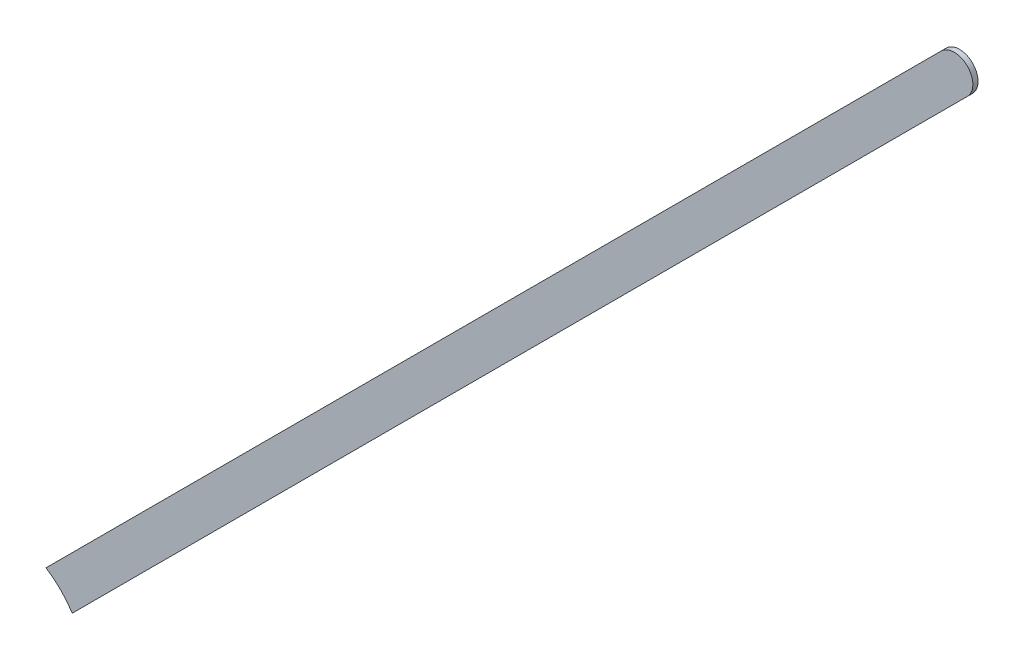
ISO-10303-21;
HEADER;
FILE_DESCRIPTION(('STEP AP214'),'2;1');
FILE_NAME('part.step','',(''),(''),'','','');
FILE_SCHEMA(('AUTOMOTIVE_DESIGN { 1 0 10303 214 1 1 1 1 }'));
ENDSEC;
DATA;
#1=APPLICATION_CONTEXT('core data for automotive mechanical design processes');
#2=APPLICATION_PROTOCOL_DEFINITION('international standard','automotive_design',2000,#1);
#3=PRODUCT_CONTEXT('',#1,'mechanical');
#4=PRODUCT('Part','Part','',(#3));
#5=PRODUCT_RELATED_PRODUCT_CATEGORY('part','',(#4));
#6=PRODUCT_DEFINITION_FORMATION('','',#4);
#7=PRODUCT_DEFINITION_CONTEXT('part definition',#1,'design');
#8=PRODUCT_DEFINITION('design','',#6,#7);
#9=PRODUCT_DEFINITION_SHAPE('','',#8);
#10=(LENGTH_UNIT() NAMED_UNIT(*) SI_UNIT(.MILLI.,.METRE.));
#11=(NAMED_UNIT(*) PLANE_ANGLE_UNIT() SI_UNIT($,.RADIAN.));
#12=(NAMED_UNIT(*) SI_UNIT($,.STERADIAN.) SOLID_ANGLE_UNIT());
#13=UNCERTAINTY_MEASURE_WITH_UNIT(LENGTH_MEASURE(1.E-05),#10,'distance_accuracy_value','');
#14=(GEOMETRIC_REPRESENTATION_CONTEXT(3) GLOBAL_UNCERTAINTY_ASSIGNED_CONTEXT((#13)) GLOBAL_UNIT_ASSIGNED_CONTEXT((#10,
#11,#12)) REPRESENTATION_CONTEXT('',''));
#15=CARTESIAN_POINT('',(0.,0.,0.));
#16=DIRECTION('',(0.,0.,1.));
#17=DIRECTION('',(1.,0.,0.));
#18=AXIS2_PLACEMENT_3D('',#15,#16,#17);
#19=CARTESIAN_POINT('',(82.5761605839932,49.0859278439932,0.));
#20=DIRECTION('',(-0.707106781186548,0.707106781186548,0.));
#21=DIRECTION('',(0.707106781186548,0.707106781186548,0.));
#22=AXIS2_PLACEMENT_3D('',#19,#20,#21);
#23=PLANE('',#22);
#24=DIRECTION('',(0.707106781186548,0.707106781186548,0.));
#25=VECTOR('',#24,1.);
#26=CARTESIAN_POINT('',(82.1651265,48.67489376,0.03556));
#27=LINE('',#26,#25);
#28=CARTESIAN_POINT('',(82.5761605839932,49.0859278439932,0.03556));
#29=VERTEX_POINT('',#28);
#30=CARTESIAN_POINT('',(88.70677712,55.21654438,0.03556));
#31=VERTEX_POINT('',#30);
#32=EDGE_CURVE('E11',#29,#31,#27,.T.);
#33=ORIENTED_EDGE('',*,*,#32,.F.);
#34=DIRECTION('',(0.,0.,1.));
#35=VECTOR('',#34,1.);
#36=CARTESIAN_POINT('',(82.5761605839932,49.0859278439932,0.));
#37=LINE('',#36,#35);
#38=CARTESIAN_POINT('',(82.5761605839932,49.0859278439932,0.));
#39=VERTEX_POINT('',#38);
#40=EDGE_CURVE('E24',#39,#29,#37,.T.);
#41=ORIENTED_EDGE('',*,*,#40,.F.);
#42=DIRECTION('',(0.707106781186548,0.707106781186548,0.));
#43=VECTOR('',#42,1.);
#44=CARTESIAN_POINT('',(82.1651265,48.67489376,0.));
#45=LINE('',#44,#43);
#46=CARTESIAN_POINT('',(88.70677712,55.21654438,0.));
#47=VERTEX_POINT('',#46);
#48=EDGE_CURVE('E75',#39,#47,#45,.T.);
#49=ORIENTED_EDGE('',*,*,#48,.T.);
#50=DIRECTION('',(0.,0.,1.));
#51=VECTOR('',#50,1.);
#52=CARTESIAN_POINT('',(88.70677712,55.21654438,0.));
#53=LINE('',#52,#51);
#54=EDGE_CURVE('E37',#47,#31,#53,.T.);
#55=ORIENTED_EDGE('',*,*,#54,.T.);
#56=EDGE_LOOP('',(#33,#41,#49,#55));
#57=FACE_BOUND('',#56,.T.);
#58=ADVANCED_FACE('F17',(#57),#23,.F.);
#59=CARTESIAN_POINT('',(88.61697415,55.30634735,0.));
#60=DIRECTION('',(0.,0.,-1.));
#61=DIRECTION('',(0.70710678118652,-0.707106781186576,0.));
#62=AXIS2_PLACEMENT_3D('',#59,#60,#61);
#63=CYLINDRICAL_SURFACE('',#62,0.127000578115384);
#64=CARTESIAN_POINT('',(88.61697415,55.30634735,0.03556));
#65=DIRECTION('',(0.,0.,1.));
#66=DIRECTION('',(0.70710678118652,-0.707106781186576,0.));
#67=AXIS2_PLACEMENT_3D('',#64,#65,#66);
#68=CIRCLE('',#67,0.127000578115384);
#69=CARTESIAN_POINT('',(88.52717118,55.39615032,0.03556));
#70=VERTEX_POINT('',#69);
#71=EDGE_CURVE('E83',#31,#70,#68,.T.);
#72=ORIENTED_EDGE('',*,*,#71,.F.);
#73=ORIENTED_EDGE('',*,*,#54,.F.);
#74=CARTESIAN_POINT('',(88.61697415,55.30634735,0.));
#75=DIRECTION('',(0.,0.,1.));
#76=DIRECTION('',(0.70710678118652,-0.707106781186576,0.));
#77=AXIS2_PLACEMENT_3D('',#74,#75,#76);
#78=CIRCLE('',#77,0.127000578115384);
#79=CARTESIAN_POINT('',(88.52717118,55.39615032,0.));
#80=VERTEX_POINT('',#79);
#81=EDGE_CURVE('E81',#47,#80,#78,.T.);
#82=ORIENTED_EDGE('',*,*,#81,.T.);
#83=DIRECTION('',(0.,0.,1.));
#84=VECTOR('',#83,1.);
#85=CARTESIAN_POINT('',(88.52717118,55.39615032,0.));
#86=LINE('',#85,#84);
#87=EDGE_CURVE('E67',#80,#70,#86,.T.);
#88=ORIENTED_EDGE('',*,*,#87,.T.);
#89=EDGE_LOOP('',(#72,#73,#82,#88));
#90=FACE_BOUND('',#89,.T.);
#91=ADVANCED_FACE('F89',(#90),#63,.T.);
#92=CARTESIAN_POINT('',(88.52717118,55.39615032,0.));
#93=DIRECTION('',(0.707106781186548,-0.707106781186547,0.));
#94=DIRECTION('',(-0.707106781186547,-0.707106781186548,0.));
#95=AXIS2_PLACEMENT_3D('',#92,#93,#94);
#96=PLANE('',#95);
#97=DIRECTION('',(-0.707106781186547,-0.707106781186548,0.));
#98=VECTOR('',#97,1.);
#99=CARTESIAN_POINT('',(88.52717118,55.39615032,0.03556));
#100=LINE('',#99,#98);
#101=CARTESIAN_POINT('',(82.3965546439932,49.2655337839932,0.03556));
#102=VERTEX_POINT('',#101);
#103=EDGE_CURVE('E71',#70,#102,#100,.T.);
#104=ORIENTED_EDGE('',*,*,#103,.F.);
#105=ORIENTED_EDGE('',*,*,#87,.F.);
#106=DIRECTION('',(-0.707106781186547,-0.707106781186548,0.));
#107=VECTOR('',#106,1.);
#108=CARTESIAN_POINT('',(88.52717118,55.39615032,0.));
#109=LINE('',#108,#107);
#110=CARTESIAN_POINT('',(82.3965546439932,49.2655337839932,0.));
#111=VERTEX_POINT('',#110);
#112=EDGE_CURVE('E63',#80,#111,#109,.T.);
#113=ORIENTED_EDGE('',*,*,#112,.T.);
#114=DIRECTION('',(0.,0.,1.));
#115=VECTOR('',#114,1.);
#116=CARTESIAN_POINT('',(82.3965546439932,49.2655337839932,0.));
#117=LINE('',#116,#115);
#118=EDGE_CURVE('E53',#111,#102,#117,.T.);
#119=ORIENTED_EDGE('',*,*,#118,.T.);
#120=EDGE_LOOP('',(#104,#105,#113,#119));
#121=FACE_BOUND('',#120,.T.);
#122=ADVANCED_FACE('F66',(#121),#96,.F.);
#123=CARTESIAN_POINT('',(82.0753248,48.764698,0.));
#124=DIRECTION('',(0.,0.,-1.));
#125=DIRECTION('',(1.,0.,0.));
#126=AXIS2_PLACEMENT_3D('',#123,#124,#125);
#127=CYLINDRICAL_SURFACE('',#126,0.59500008);
#128=ORIENTED_EDGE('',*,*,#40,.T.);
#129=CARTESIAN_POINT('',(82.0753248,48.764698,0.03556));
#130=DIRECTION('',(0.,0.,1.));
#131=DIRECTION('',(1.,0.,0.));
#132=AXIS2_PLACEMENT_3D('',#129,#130,#131);
#133=CIRCLE('',#132,0.59500008);
#134=EDGE_CURVE('E59',#29,#102,#133,.T.);
#135=ORIENTED_EDGE('',*,*,#134,.T.);
#136=ORIENTED_EDGE('',*,*,#118,.F.);
#137=CARTESIAN_POINT('',(82.0753248,48.764698,0.));
#138=DIRECTION('',(0.,0.,1.));
#139=DIRECTION('',(1.,0.,0.));
#140=AXIS2_PLACEMENT_3D('',#137,#138,#139);
#141=CIRCLE('',#140,0.59500008);
#142=EDGE_CURVE('E57',#39,#111,#141,.T.);
#143=ORIENTED_EDGE('',*,*,#142,.F.);
#144=EDGE_LOOP('',(#128,#135,#136,#143));
#145=FACE_BOUND('',#144,.T.);
#146=ADVANCED_FACE('F55',(#145),#127,.F.);
#147=CARTESIAN_POINT('',(82.1651265,48.67489376,0.));
#148=DIRECTION('',(0.,0.,-1.));
#149=DIRECTION('',(-1.,0.,0.));
#150=AXIS2_PLACEMENT_3D('',#147,#148,#149);
#151=PLANE('',#150);
#152=ORIENTED_EDGE('',*,*,#48,.F.);
#153=ORIENTED_EDGE('',*,*,#142,.T.);
#154=ORIENTED_EDGE('',*,*,#112,.F.);
#155=ORIENTED_EDGE('',*,*,#81,.F.);
#156=EDGE_LOOP('',(#152,#153,#154,#155));
#157=FACE_BOUND('',#156,.T.);
#158=ADVANCED_FACE('F74',(#157),#151,.T.);
#159=CARTESIAN_POINT('',(82.1651265,48.67489376,0.03556));
#160=DIRECTION('',(0.,0.,-1.));
#161=DIRECTION('',(-1.,0.,0.));
#162=AXIS2_PLACEMENT_3D('',#159,#160,#161);
#163=PLANE('',#162);
#164=ORIENTED_EDGE('',*,*,#134,.F.);
#165=ORIENTED_EDGE('',*,*,#32,.T.);
#166=ORIENTED_EDGE('',*,*,#71,.T.);
#167=ORIENTED_EDGE('',*,*,#103,.T.);
#168=EDGE_LOOP('',(#164,#165,#166,#167));
#169=FACE_BOUND('',#168,.T.);
#170=ADVANCED_FACE('F91',(#169),#163,.F.);
#171=CLOSED_SHELL('',(#58,#91,#122,#146,#158,#170));
#172=MANIFOLD_SOLID_BREP('B1',#171);
#173=ADVANCED_BREP_SHAPE_REPRESENTATION('',(#18,#172),#14);
#174=SHAPE_DEFINITION_REPRESENTATION(#9,#173);
ENDSEC;
END-ISO-10303-21;
